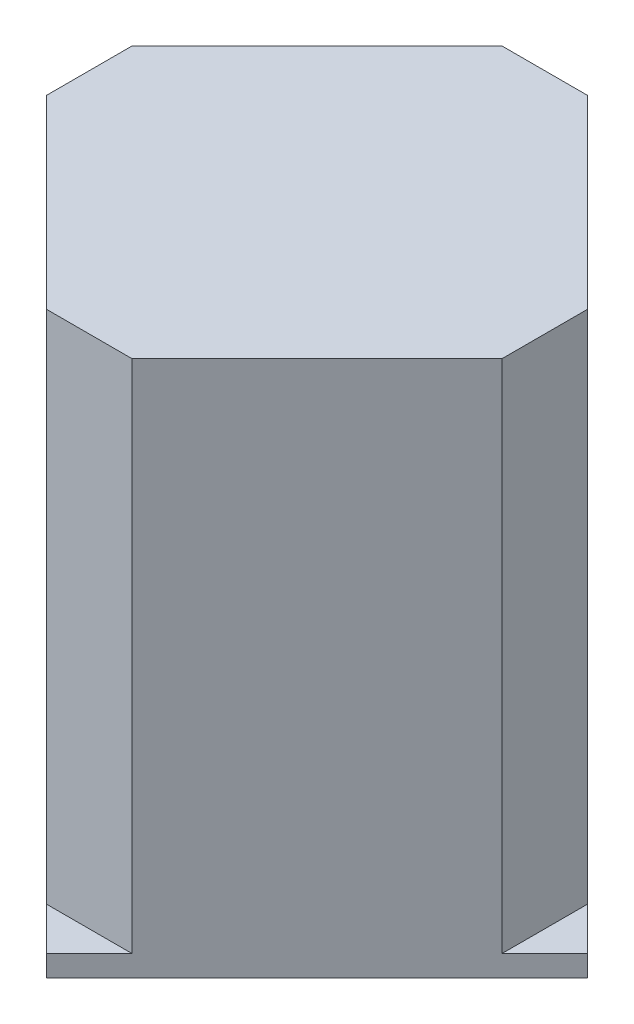
ISO-10303-21;
HEADER;
FILE_DESCRIPTION(('STEP AP214'),'2;1');
FILE_NAME('part.step','',(''),(''),'','','');
FILE_SCHEMA(('AUTOMOTIVE_DESIGN { 1 0 10303 214 1 1 1 1 }'));
ENDSEC;
DATA;
#1=APPLICATION_CONTEXT('core data for automotive mechanical design processes');
#2=APPLICATION_PROTOCOL_DEFINITION('international standard','automotive_design',2000,#1);
#3=PRODUCT_CONTEXT('',#1,'mechanical');
#4=PRODUCT('Part','Part','',(#3));
#5=PRODUCT_RELATED_PRODUCT_CATEGORY('part','',(#4));
#6=PRODUCT_DEFINITION_FORMATION('','',#4);
#7=PRODUCT_DEFINITION_CONTEXT('part definition',#1,'design');
#8=PRODUCT_DEFINITION('design','',#6,#7);
#9=PRODUCT_DEFINITION_SHAPE('','',#8);
#10=(LENGTH_UNIT() NAMED_UNIT(*) SI_UNIT(.MILLI.,.METRE.));
#11=(NAMED_UNIT(*) PLANE_ANGLE_UNIT() SI_UNIT($,.RADIAN.));
#12=(NAMED_UNIT(*) SI_UNIT($,.STERADIAN.) SOLID_ANGLE_UNIT());
#13=UNCERTAINTY_MEASURE_WITH_UNIT(LENGTH_MEASURE(1.E-05),#10,'distance_accuracy_value','');
#14=(GEOMETRIC_REPRESENTATION_CONTEXT(3) GLOBAL_UNCERTAINTY_ASSIGNED_CONTEXT((#13)) GLOBAL_UNIT_ASSIGNED_CONTEXT((#10,
#11,#12)) REPRESENTATION_CONTEXT('',''));
#15=CARTESIAN_POINT('',(0.,0.,0.));
#16=DIRECTION('',(0.,0.,1.));
#17=DIRECTION('',(1.,0.,0.));
#18=AXIS2_PLACEMENT_3D('',#15,#16,#17);
#19=CARTESIAN_POINT('',(304.543783131468,42.9999999999952,1399.83451401052));
#20=DIRECTION('',(0.707106781186501,0.,0.707106781186594));
#21=DIRECTION('',(0.,-1.,0.));
#22=AXIS2_PLACEMENT_3D('',#19,#20,#21);
#23=PLANE('',#22);
#24=DIRECTION('',(0.,-1.,0.));
#25=VECTOR('',#24,1.);
#26=CARTESIAN_POINT('',(259.872312230005,32.9999999999993,1444.50598491198));
#27=LINE('',#26,#25);
#28=CARTESIAN_POINT('',(259.872312230005,42.9999999999993,1444.50598491198));
#29=VERTEX_POINT('',#28);
#30=CARTESIAN_POINT('',(259.872312230005,35.9999999999952,1444.50598491198));
#31=VERTEX_POINT('',#30);
#32=EDGE_CURVE('E112',#29,#31,#27,.T.);
#33=ORIENTED_EDGE('',*,*,#32,.T.);
#34=DIRECTION('',(0.707106781186594,0.,-0.707106781186501));
#35=VECTOR('',#34,1.);
#36=CARTESIAN_POINT('',(304.543783131468,35.9999999999952,1399.83451401052));
#37=LINE('',#36,#35);
#38=CARTESIAN_POINT('',(349.215254032931,35.9999999999952,1355.16304310907));
#39=VERTEX_POINT('',#38);
#40=EDGE_CURVE('E103',#31,#39,#37,.T.);
#41=ORIENTED_EDGE('',*,*,#40,.T.);
#42=DIRECTION('',(0.,-1.,0.));
#43=VECTOR('',#42,1.);
#44=CARTESIAN_POINT('',(349.21525403293,32.999999999991,1355.16304310907));
#45=LINE('',#44,#43);
#46=CARTESIAN_POINT('',(349.215254032931,42.9999999999911,1355.16304310907));
#47=VERTEX_POINT('',#46);
#48=EDGE_CURVE('E20',#47,#39,#45,.T.);
#49=ORIENTED_EDGE('',*,*,#48,.F.);
#50=DIRECTION('',(-0.707106781186596,0.,0.707106781186499));
#51=VECTOR('',#50,1.);
#52=CARTESIAN_POINT('',(349.215254032931,42.9999999999911,1355.16304310907));
#53=LINE('',#52,#51);
#54=CARTESIAN_POINT('',(335.0731184092,42.9999999999923,1369.3051787328));
#55=VERTEX_POINT('',#54);
#56=EDGE_CURVE('E111',#47,#55,#53,.T.);
#57=ORIENTED_EDGE('',*,*,#56,.T.);
#58=DIRECTION('',(0.,1.,0.));
#59=VECTOR('',#58,1.);
#60=CARTESIAN_POINT('',(335.0731184092,42.9999999999923,1369.3051787328));
#61=LINE('',#60,#59);
#62=CARTESIAN_POINT('',(335.073118409207,212.999999999992,1369.30517873279));
#63=VERTEX_POINT('',#62);
#64=EDGE_CURVE('E183',#55,#63,#61,.T.);
#65=ORIENTED_EDGE('',*,*,#64,.T.);
#66=DIRECTION('',(-0.707106781186594,0.,0.707106781186501));
#67=VECTOR('',#66,1.);
#68=CARTESIAN_POINT('',(304.543783131476,212.999999999995,1399.83451401051));
#69=LINE('',#68,#67);
#70=CARTESIAN_POINT('',(274.014447853745,213.,1430.36384928824));
#71=VERTEX_POINT('',#70);
#72=EDGE_CURVE('E186',#63,#71,#69,.T.);
#73=ORIENTED_EDGE('',*,*,#72,.T.);
#74=DIRECTION('',(0.,-1.,0.));
#75=VECTOR('',#74,1.);
#76=CARTESIAN_POINT('',(274.014447853737,42.999999999998,1430.36384928825));
#77=LINE('',#76,#75);
#78=CARTESIAN_POINT('',(274.014447853736,42.999999999998,1430.36384928825));
#79=VERTEX_POINT('',#78);
#80=EDGE_CURVE('E191',#71,#79,#77,.T.);
#81=ORIENTED_EDGE('',*,*,#80,.T.);
#82=EDGE_CURVE('E116',#79,#29,#53,.T.);
#83=ORIENTED_EDGE('',*,*,#82,.T.);
#84=EDGE_LOOP('',(#33,#41,#49,#57,#65,#73,#81,#83));
#85=FACE_BOUND('',#84,.T.);
#86=ADVANCED_FACE('F16',(#85),#23,.T.);
#87=CARTESIAN_POINT('',(215.200841328548,42.9999999999993,1399.83451401052));
#88=DIRECTION('',(-0.707106781186594,0.,0.707106781186501));
#89=DIRECTION('',(0.,1.,0.));
#90=AXIS2_PLACEMENT_3D('',#87,#88,#89);
#91=PLANE('',#90);
#92=DIRECTION('',(0.,-1.,0.));
#93=VECTOR('',#92,1.);
#94=CARTESIAN_POINT('',(170.52937042709,32.9999999999993,1355.16304310905));
#95=LINE('',#94,#93);
#96=CARTESIAN_POINT('',(170.52937042709,42.9999999999993,1355.16304310905));
#97=VERTEX_POINT('',#96);
#98=CARTESIAN_POINT('',(170.52937042709,35.9999999999952,1355.16304310905));
#99=VERTEX_POINT('',#98);
#100=EDGE_CURVE('E122',#97,#99,#95,.T.);
#101=ORIENTED_EDGE('',*,*,#100,.T.);
#102=DIRECTION('',(0.707106781186501,0.,0.707106781186594));
#103=VECTOR('',#102,1.);
#104=CARTESIAN_POINT('',(215.200841328548,35.9999999999952,1399.83451401052));
#105=LINE('',#104,#103);
#106=EDGE_CURVE('E106',#99,#31,#105,.T.);
#107=ORIENTED_EDGE('',*,*,#106,.T.);
#108=ORIENTED_EDGE('',*,*,#32,.F.);
#109=DIRECTION('',(0.707106781186499,0.,0.707106781186596));
#110=VECTOR('',#109,1.);
#111=CARTESIAN_POINT('',(170.52937042709,42.9999999999993,1355.16304310905));
#112=LINE('',#111,#110);
#113=CARTESIAN_POINT('',(245.730176606274,42.9999999999993,1430.36384928825));
#114=VERTEX_POINT('',#113);
#115=EDGE_CURVE('E11',#114,#29,#112,.T.);
#116=ORIENTED_EDGE('',*,*,#115,.F.);
#117=DIRECTION('',(0.,1.,0.));
#118=VECTOR('',#117,1.);
#119=CARTESIAN_POINT('',(245.730176606275,42.9999999999993,1430.36384928825));
#120=LINE('',#119,#118);
#121=CARTESIAN_POINT('',(245.730176606283,213.,1430.36384928824));
#122=VERTEX_POINT('',#121);
#123=EDGE_CURVE('E123',#114,#122,#120,.T.);
#124=ORIENTED_EDGE('',*,*,#123,.T.);
#125=DIRECTION('',(-0.707106781186501,0.,-0.707106781186594));
#126=VECTOR('',#125,1.);
#127=CARTESIAN_POINT('',(215.200841328556,213.,1399.83451401051));
#128=LINE('',#127,#126);
#129=CARTESIAN_POINT('',(184.671506050829,213.,1369.30517873278));
#130=VERTEX_POINT('',#129);
#131=EDGE_CURVE('E126',#122,#130,#128,.T.);
#132=ORIENTED_EDGE('',*,*,#131,.T.);
#133=DIRECTION('',(0.,-1.,0.));
#134=VECTOR('',#133,1.);
#135=CARTESIAN_POINT('',(184.671506050821,42.9999999999993,1369.30517873279));
#136=LINE('',#135,#134);
#137=CARTESIAN_POINT('',(184.671506050821,42.9999999999993,1369.30517873279));
#138=VERTEX_POINT('',#137);
#139=EDGE_CURVE('E134',#130,#138,#136,.T.);
#140=ORIENTED_EDGE('',*,*,#139,.T.);
#141=EDGE_CURVE('E156',#97,#138,#112,.T.);
#142=ORIENTED_EDGE('',*,*,#141,.F.);
#143=EDGE_LOOP('',(#101,#107,#108,#116,#124,#132,#140,#142));
#144=FACE_BOUND('',#143,.T.);
#145=ADVANCED_FACE('F119',(#144),#91,.T.);
#146=CARTESIAN_POINT('',(215.200841328553,42.9999999999952,1310.4915722076));
#147=DIRECTION('',(-0.707106781186501,0.,-0.707106781186594));
#148=DIRECTION('',(0.,1.,0.));
#149=AXIS2_PLACEMENT_3D('',#146,#147,#148);
#150=PLANE('',#149);
#151=DIRECTION('',(0.,-1.,0.));
#152=VECTOR('',#151,1.);
#153=CARTESIAN_POINT('',(259.872312230017,32.999999999991,1265.82010130614));
#154=LINE('',#153,#152);
#155=CARTESIAN_POINT('',(259.872312230017,42.9999999999911,1265.82010130614));
#156=VERTEX_POINT('',#155);
#157=CARTESIAN_POINT('',(259.872312230017,35.9999999999952,1265.82010130614));
#158=VERTEX_POINT('',#157);
#159=EDGE_CURVE('E133',#156,#158,#154,.T.);
#160=ORIENTED_EDGE('',*,*,#159,.T.);
#161=DIRECTION('',(-0.707106781186594,0.,0.707106781186501));
#162=VECTOR('',#161,1.);
#163=CARTESIAN_POINT('',(215.200841328553,35.9999999999952,1310.4915722076));
#164=LINE('',#163,#162);
#165=EDGE_CURVE('E39',#158,#99,#164,.T.);
#166=ORIENTED_EDGE('',*,*,#165,.T.);
#167=ORIENTED_EDGE('',*,*,#100,.F.);
#168=DIRECTION('',(-0.707106781186596,0.,0.707106781186499));
#169=VECTOR('',#168,1.);
#170=CARTESIAN_POINT('',(259.872312230017,42.9999999999911,1265.82010130614));
#171=LINE('',#170,#169);
#172=CARTESIAN_POINT('',(184.671506050823,42.999999999998,1341.02090748532));
#173=VERTEX_POINT('',#172);
#174=EDGE_CURVE('E155',#173,#97,#171,.T.);
#175=ORIENTED_EDGE('',*,*,#174,.F.);
#176=DIRECTION('',(0.,1.,0.));
#177=VECTOR('',#176,1.);
#178=CARTESIAN_POINT('',(184.671506050823,42.999999999998,1341.02090748532));
#179=LINE('',#178,#177);
#180=CARTESIAN_POINT('',(184.67150605083,213.,1341.02090748532));
#181=VERTEX_POINT('',#180);
#182=EDGE_CURVE('E132',#173,#181,#179,.T.);
#183=ORIENTED_EDGE('',*,*,#182,.T.);
#184=DIRECTION('',(0.707106781186594,0.,-0.707106781186501));
#185=VECTOR('',#184,1.);
#186=CARTESIAN_POINT('',(215.200841328562,212.999999999995,1310.49157220759));
#187=LINE('',#186,#185);
#188=CARTESIAN_POINT('',(245.730176606293,212.999999999992,1279.96223692986));
#189=VERTEX_POINT('',#188);
#190=EDGE_CURVE('E150',#181,#189,#187,.T.);
#191=ORIENTED_EDGE('',*,*,#190,.T.);
#192=DIRECTION('',(0.,-1.,0.));
#193=VECTOR('',#192,1.);
#194=CARTESIAN_POINT('',(245.730176606285,42.9999999999923,1279.96223692987));
#195=LINE('',#194,#193);
#196=CARTESIAN_POINT('',(245.730176606285,42.9999999999923,1279.96223692987));
#197=VERTEX_POINT('',#196);
#198=EDGE_CURVE('E209',#189,#197,#195,.T.);
#199=ORIENTED_EDGE('',*,*,#198,.T.);
#200=EDGE_CURVE('E172',#156,#197,#171,.T.);
#201=ORIENTED_EDGE('',*,*,#200,.F.);
#202=EDGE_LOOP('',(#160,#166,#167,#175,#183,#191,#199,#201));
#203=FACE_BOUND('',#202,.T.);
#204=ADVANCED_FACE('F237',(#203),#150,.T.);
#205=CARTESIAN_POINT('',(304.543783131474,42.9999999999911,1310.4915722076));
#206=DIRECTION('',(0.707106781186594,0.,-0.707106781186501));
#207=DIRECTION('',(0.,-1.,0.));
#208=AXIS2_PLACEMENT_3D('',#205,#206,#207);
#209=PLANE('',#208);
#210=ORIENTED_EDGE('',*,*,#48,.T.);
#211=DIRECTION('',(-0.707106781186501,0.,-0.707106781186594));
#212=VECTOR('',#211,1.);
#213=CARTESIAN_POINT('',(304.543783131474,35.9999999999952,1310.4915722076));
#214=LINE('',#213,#212);
#215=EDGE_CURVE('E33',#39,#158,#214,.T.);
#216=ORIENTED_EDGE('',*,*,#215,.T.);
#217=ORIENTED_EDGE('',*,*,#159,.F.);
#218=DIRECTION('',(0.707106781186499,0.,0.707106781186596));
#219=VECTOR('',#218,1.);
#220=CARTESIAN_POINT('',(259.872312230017,42.9999999999911,1265.82010130614));
#221=LINE('',#220,#219);
#222=CARTESIAN_POINT('',(274.014447853747,42.9999999999911,1279.96223692987));
#223=VERTEX_POINT('',#222);
#224=EDGE_CURVE('E214',#156,#223,#221,.T.);
#225=ORIENTED_EDGE('',*,*,#224,.T.);
#226=DIRECTION('',(0.,1.,0.));
#227=VECTOR('',#226,1.);
#228=CARTESIAN_POINT('',(274.014447853747,42.9999999999911,1279.96223692987));
#229=LINE('',#228,#227);
#230=CARTESIAN_POINT('',(274.014447853755,212.999999999991,1279.96223692986));
#231=VERTEX_POINT('',#230);
#232=EDGE_CURVE('E173',#223,#231,#229,.T.);
#233=ORIENTED_EDGE('',*,*,#232,.T.);
#234=DIRECTION('',(0.707106781186501,0.,0.707106781186594));
#235=VECTOR('',#234,1.);
#236=CARTESIAN_POINT('',(304.543783131482,212.999999999991,1310.49157220759));
#237=LINE('',#236,#235);
#238=CARTESIAN_POINT('',(335.073118409209,212.999999999991,1341.02090748533));
#239=VERTEX_POINT('',#238);
#240=EDGE_CURVE('E180',#231,#239,#237,.T.);
#241=ORIENTED_EDGE('',*,*,#240,.T.);
#242=DIRECTION('',(0.,-1.,0.));
#243=VECTOR('',#242,1.);
#244=CARTESIAN_POINT('',(335.073118409201,42.9999999999911,1341.02090748533));
#245=LINE('',#244,#243);
#246=CARTESIAN_POINT('',(335.073118409202,42.9999999999911,1341.02090748533));
#247=VERTEX_POINT('',#246);
#248=EDGE_CURVE('E177',#239,#247,#245,.T.);
#249=ORIENTED_EDGE('',*,*,#248,.T.);
#250=EDGE_CURVE('E179',#247,#47,#221,.T.);
#251=ORIENTED_EDGE('',*,*,#250,.T.);
#252=EDGE_LOOP('',(#210,#216,#217,#225,#233,#241,#249,#251));
#253=FACE_BOUND('',#252,.T.);
#254=ADVANCED_FACE('F245',(#253),#209,.T.);
#255=CARTESIAN_POINT('',(259.872312230019,212.999999999995,1355.16304310905));
#256=DIRECTION('',(0.,1.,0.));
#257=DIRECTION('',(0.707106781186594,0.,-0.707106781186501));
#258=AXIS2_PLACEMENT_3D('',#255,#256,#257);
#259=PLANE('',#258);
#260=ORIENTED_EDGE('',*,*,#190,.F.);
#261=DIRECTION('',(0.,0.,-1.));
#262=VECTOR('',#261,1.);
#263=CARTESIAN_POINT('',(184.67150605083,213.,1355.16304310905));
#264=LINE('',#263,#262);
#265=EDGE_CURVE('E197',#181,#130,#264,.F.);
#266=ORIENTED_EDGE('',*,*,#265,.T.);
#267=ORIENTED_EDGE('',*,*,#131,.F.);
#268=DIRECTION('',(-1.,0.,0.));
#269=VECTOR('',#268,1.);
#270=CARTESIAN_POINT('',(259.872312230014,213.,1430.36384928824));
#271=LINE('',#270,#269);
#272=EDGE_CURVE('E199',#122,#71,#271,.F.);
#273=ORIENTED_EDGE('',*,*,#272,.T.);
#274=ORIENTED_EDGE('',*,*,#72,.F.);
#275=DIRECTION('',(0.,0.,1.));
#276=VECTOR('',#275,1.);
#277=CARTESIAN_POINT('',(335.073118409208,212.999999999991,1355.16304310906));
#278=LINE('',#277,#276);
#279=EDGE_CURVE('E202',#63,#239,#278,.F.);
#280=ORIENTED_EDGE('',*,*,#279,.T.);
#281=ORIENTED_EDGE('',*,*,#240,.F.);
#282=DIRECTION('',(1.,0.,0.));
#283=VECTOR('',#282,1.);
#284=CARTESIAN_POINT('',(259.872312230024,212.999999999991,1279.96223692986));
#285=LINE('',#284,#283);
#286=EDGE_CURVE('E200',#231,#189,#285,.F.);
#287=ORIENTED_EDGE('',*,*,#286,.T.);
#288=EDGE_LOOP('',(#260,#266,#267,#273,#274,#280,#281,#287));
#289=FACE_BOUND('',#288,.T.);
#290=ADVANCED_FACE('F249',(#289),#259,.T.);
#291=CARTESIAN_POINT('',(184.671506050823,42.999999999998,1341.02090748532));
#292=DIRECTION('',(1.,0.,0.));
#293=DIRECTION('',(0.,0.,-1.));
#294=AXIS2_PLACEMENT_3D('',#291,#292,#293);
#295=PLANE('',#294);
#296=DIRECTION('',(0.,0.,1.));
#297=VECTOR('',#296,1.);
#298=CARTESIAN_POINT('',(184.671506050822,42.9999999999986,1355.16304310905));
#299=LINE('',#298,#297);
#300=EDGE_CURVE('E151',#138,#173,#299,.F.);
#301=ORIENTED_EDGE('',*,*,#300,.F.);
#302=ORIENTED_EDGE('',*,*,#139,.F.);
#303=ORIENTED_EDGE('',*,*,#265,.F.);
#304=ORIENTED_EDGE('',*,*,#182,.F.);
#305=EDGE_LOOP('',(#301,#302,#303,#304));
#306=FACE_BOUND('',#305,.T.);
#307=ADVANCED_FACE('F282',(#306),#295,.F.);
#308=CARTESIAN_POINT('',(274.014447853747,42.9999999999911,1279.96223692987));
#309=DIRECTION('',(0.,0.,1.));
#310=DIRECTION('',(1.,0.,0.));
#311=AXIS2_PLACEMENT_3D('',#308,#309,#310);
#312=PLANE('',#311);
#313=DIRECTION('',(-1.,0.,0.));
#314=VECTOR('',#313,1.);
#315=CARTESIAN_POINT('',(259.872312230017,42.9999999999917,1279.96223692987));
#316=LINE('',#315,#314);
#317=EDGE_CURVE('E167',#197,#223,#316,.F.);
#318=ORIENTED_EDGE('',*,*,#317,.F.);
#319=ORIENTED_EDGE('',*,*,#198,.F.);
#320=ORIENTED_EDGE('',*,*,#286,.F.);
#321=ORIENTED_EDGE('',*,*,#232,.F.);
#322=EDGE_LOOP('',(#318,#319,#320,#321));
#323=FACE_BOUND('',#322,.T.);
#324=ADVANCED_FACE('F241',(#323),#312,.F.);
#325=CARTESIAN_POINT('',(335.0731184092,42.9999999999923,1369.3051787328));
#326=DIRECTION('',(-1.,0.,0.));
#327=DIRECTION('',(0.,0.,1.));
#328=AXIS2_PLACEMENT_3D('',#325,#326,#327);
#329=PLANE('',#328);
#330=DIRECTION('',(0.,0.,-1.));
#331=VECTOR('',#330,1.);
#332=CARTESIAN_POINT('',(335.073118409201,42.9999999999917,1355.16304310906));
#333=LINE('',#332,#331);
#334=EDGE_CURVE('E171',#247,#55,#333,.F.);
#335=ORIENTED_EDGE('',*,*,#334,.F.);
#336=ORIENTED_EDGE('',*,*,#248,.F.);
#337=ORIENTED_EDGE('',*,*,#279,.F.);
#338=ORIENTED_EDGE('',*,*,#64,.F.);
#339=EDGE_LOOP('',(#335,#336,#337,#338));
#340=FACE_BOUND('',#339,.T.);
#341=ADVANCED_FACE('F253',(#340),#329,.F.);
#342=CARTESIAN_POINT('',(245.730176606275,42.9999999999993,1430.36384928825));
#343=DIRECTION('',(0.,0.,-1.));
#344=DIRECTION('',(-1.,0.,0.));
#345=AXIS2_PLACEMENT_3D('',#342,#343,#344);
#346=PLANE('',#345);
#347=DIRECTION('',(1.,0.,0.));
#348=VECTOR('',#347,1.);
#349=CARTESIAN_POINT('',(259.872312230005,42.9999999999986,1430.36384928825));
#350=LINE('',#349,#348);
#351=EDGE_CURVE('E25',#79,#114,#350,.F.);
#352=ORIENTED_EDGE('',*,*,#351,.F.);
#353=ORIENTED_EDGE('',*,*,#80,.F.);
#354=ORIENTED_EDGE('',*,*,#272,.F.);
#355=ORIENTED_EDGE('',*,*,#123,.F.);
#356=EDGE_LOOP('',(#352,#353,#354,#355));
#357=FACE_BOUND('',#356,.T.);
#358=ADVANCED_FACE('F293',(#357),#346,.F.);
#359=CARTESIAN_POINT('',(349.215254032931,42.9999999999911,1355.16304310907));
#360=DIRECTION('',(0.,1.,0.));
#361=DIRECTION('',(-1.,0.,0.));
#362=AXIS2_PLACEMENT_3D('',#359,#360,#361);
#363=PLANE('',#362);
#364=ORIENTED_EDGE('',*,*,#141,.T.);
#365=ORIENTED_EDGE('',*,*,#300,.T.);
#366=ORIENTED_EDGE('',*,*,#174,.T.);
#367=EDGE_LOOP('',(#364,#365,#366));
#368=FACE_BOUND('',#367,.T.);
#369=ADVANCED_FACE('F268',(#368),#363,.T.);
#370=ORIENTED_EDGE('',*,*,#200,.T.);
#371=ORIENTED_EDGE('',*,*,#317,.T.);
#372=ORIENTED_EDGE('',*,*,#224,.F.);
#373=EDGE_LOOP('',(#370,#371,#372));
#374=FACE_BOUND('',#373,.T.);
#375=ADVANCED_FACE('F244',(#374),#363,.T.);
#376=ORIENTED_EDGE('',*,*,#250,.F.);
#377=ORIENTED_EDGE('',*,*,#334,.T.);
#378=ORIENTED_EDGE('',*,*,#56,.F.);
#379=EDGE_LOOP('',(#376,#377,#378));
#380=FACE_BOUND('',#379,.T.);
#381=ADVANCED_FACE('F258',(#380),#363,.T.);
#382=ORIENTED_EDGE('',*,*,#82,.F.);
#383=ORIENTED_EDGE('',*,*,#351,.T.);
#384=ORIENTED_EDGE('',*,*,#115,.T.);
#385=EDGE_LOOP('',(#382,#383,#384));
#386=FACE_BOUND('',#385,.T.);
#387=ADVANCED_FACE('F260',(#386),#363,.T.);
#388=CARTESIAN_POINT('',(259.87231223001,35.9999999999952,1355.16304310906));
#389=DIRECTION('',(0.,-1.,0.));
#390=DIRECTION('',(0.,0.,-1.));
#391=AXIS2_PLACEMENT_3D('',#388,#389,#390);
#392=PLANE('',#391);
#393=ORIENTED_EDGE('',*,*,#40,.F.);
#394=ORIENTED_EDGE('',*,*,#106,.F.);
#395=ORIENTED_EDGE('',*,*,#165,.F.);
#396=ORIENTED_EDGE('',*,*,#215,.F.);
#397=EDGE_LOOP('',(#393,#394,#395,#396));
#398=FACE_BOUND('',#397,.T.);
#399=ADVANCED_FACE('F18',(#398),#392,.T.);
#400=CLOSED_SHELL('',(#86,#145,#204,#254,#290,#307,#324,#341,#358,#369,#375,#381,#387,#399));
#401=MANIFOLD_SOLID_BREP('B1',#400);
#402=ADVANCED_BREP_SHAPE_REPRESENTATION('',(#18,#401),#14);
#403=SHAPE_DEFINITION_REPRESENTATION(#9,#402);
ENDSEC;
END-ISO-10303-21;
